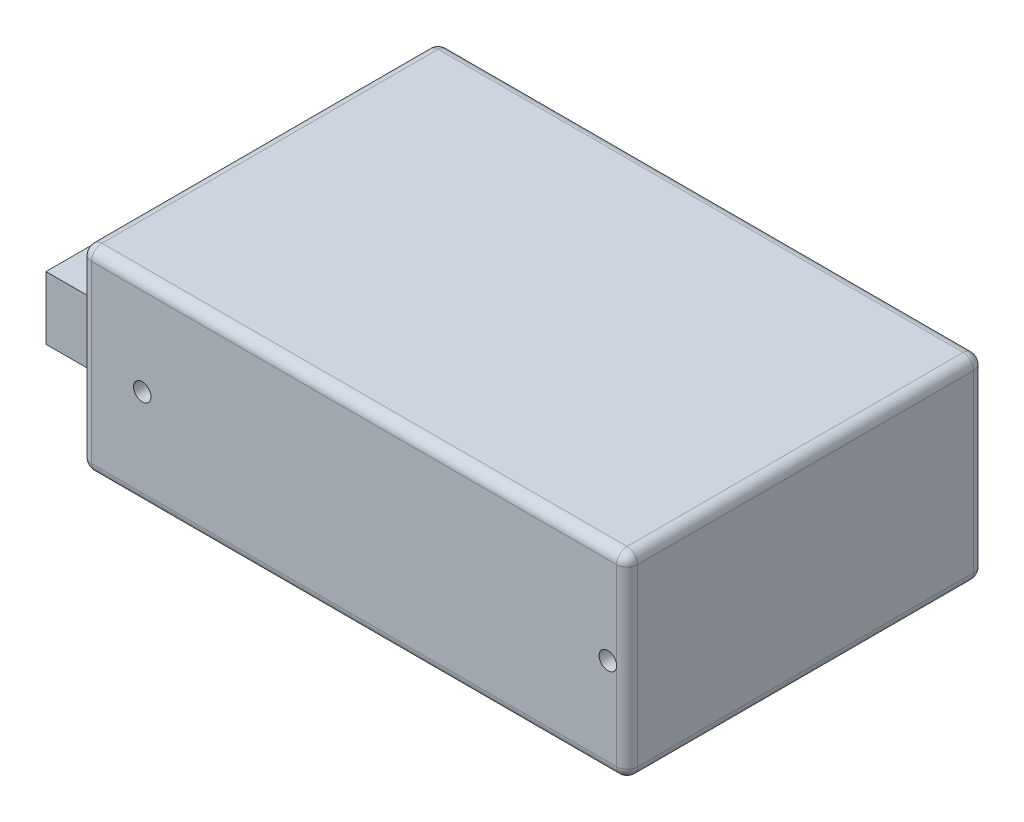
ISO-10303-21;
HEADER;
FILE_DESCRIPTION(('STEP AP214'),'2;1');
FILE_NAME('part.step','',(''),(''),'','','');
FILE_SCHEMA(('AUTOMOTIVE_DESIGN { 1 0 10303 214 1 1 1 1 }'));
ENDSEC;
DATA;
#1=APPLICATION_CONTEXT('core data for automotive mechanical design processes');
#2=APPLICATION_PROTOCOL_DEFINITION('international standard','automotive_design',2000,#1);
#3=PRODUCT_CONTEXT('',#1,'mechanical');
#4=PRODUCT('Part','Part','',(#3));
#5=PRODUCT_RELATED_PRODUCT_CATEGORY('part','',(#4));
#6=PRODUCT_DEFINITION_FORMATION('','',#4);
#7=PRODUCT_DEFINITION_CONTEXT('part definition',#1,'design');
#8=PRODUCT_DEFINITION('design','',#6,#7);
#9=PRODUCT_DEFINITION_SHAPE('','',#8);
#10=(LENGTH_UNIT() NAMED_UNIT(*) SI_UNIT(.MILLI.,.METRE.));
#11=(NAMED_UNIT(*) PLANE_ANGLE_UNIT() SI_UNIT($,.RADIAN.));
#12=(NAMED_UNIT(*) SI_UNIT($,.STERADIAN.) SOLID_ANGLE_UNIT());
#13=UNCERTAINTY_MEASURE_WITH_UNIT(LENGTH_MEASURE(1.E-05),#10,'distance_accuracy_value','');
#14=(GEOMETRIC_REPRESENTATION_CONTEXT(3) GLOBAL_UNCERTAINTY_ASSIGNED_CONTEXT((#13)) GLOBAL_UNIT_ASSIGNED_CONTEXT((#10,
#11,#12)) REPRESENTATION_CONTEXT('',''));
#15=CARTESIAN_POINT('',(0.,0.,0.));
#16=DIRECTION('',(0.,0.,1.));
#17=DIRECTION('',(1.,0.,0.));
#18=AXIS2_PLACEMENT_3D('',#15,#16,#17);
#19=CARTESIAN_POINT('',(-53.,4.,16.5));
#20=DIRECTION('',(0.,0.,-1.));
#21=DIRECTION('',(-1.,0.,0.));
#22=AXIS2_PLACEMENT_3D('',#19,#20,#21);
#23=PLANE('',#22);
#24=DIRECTION('',(0.,1.,0.));
#25=VECTOR('',#24,1.);
#26=CARTESIAN_POINT('',(-39.,4.,16.5));
#27=LINE('',#26,#25);
#28=CARTESIAN_POINT('',(-39.,4.,16.5));
#29=VERTEX_POINT('',#28);
#30=CARTESIAN_POINT('',(-39.,13.,16.5));
#31=VERTEX_POINT('',#30);
#32=EDGE_CURVE('E112',#29,#31,#27,.T.);
#33=ORIENTED_EDGE('',*,*,#32,.T.);
#34=DIRECTION('',(1.,0.,0.));
#35=VECTOR('',#34,1.);
#36=CARTESIAN_POINT('',(-53.,13.,16.5));
#37=LINE('',#36,#35);
#38=CARTESIAN_POINT('',(-53.,13.,16.5));
#39=VERTEX_POINT('',#38);
#40=EDGE_CURVE('E12',#39,#31,#37,.T.);
#41=ORIENTED_EDGE('',*,*,#40,.F.);
#42=DIRECTION('',(0.,1.,0.));
#43=VECTOR('',#42,1.);
#44=CARTESIAN_POINT('',(-53.,4.,16.5));
#45=LINE('',#44,#43);
#46=CARTESIAN_POINT('',(-53.,4.,16.5));
#47=VERTEX_POINT('',#46);
#48=EDGE_CURVE('E100',#47,#39,#45,.T.);
#49=ORIENTED_EDGE('',*,*,#48,.F.);
#50=DIRECTION('',(1.,0.,0.));
#51=VECTOR('',#50,1.);
#52=CARTESIAN_POINT('',(-53.,4.,16.5));
#53=LINE('',#52,#51);
#54=EDGE_CURVE('E108',#47,#29,#53,.T.);
#55=ORIENTED_EDGE('',*,*,#54,.T.);
#56=EDGE_LOOP('',(#33,#41,#49,#55));
#57=FACE_BOUND('',#56,.T.);
#58=ADVANCED_FACE('F49',(#57),#23,.F.);
#59=CARTESIAN_POINT('',(-53.,13.,-23.5));
#60=DIRECTION('',(0.,-1.,0.));
#61=DIRECTION('',(0.,0.,-1.));
#62=AXIS2_PLACEMENT_3D('',#59,#60,#61);
#63=PLANE('',#62);
#64=DIRECTION('',(0.,0.,-1.));
#65=VECTOR('',#64,1.);
#66=CARTESIAN_POINT('',(-39.,13.,-23.5));
#67=LINE('',#66,#65);
#68=CARTESIAN_POINT('',(-39.,13.,-23.5));
#69=VERTEX_POINT('',#68);
#70=EDGE_CURVE('E104',#31,#69,#67,.T.);
#71=ORIENTED_EDGE('',*,*,#70,.T.);
#72=DIRECTION('',(1.,0.,0.));
#73=VECTOR('',#72,1.);
#74=CARTESIAN_POINT('',(-53.,13.,-23.5));
#75=LINE('',#74,#73);
#76=CARTESIAN_POINT('',(-53.,13.,-23.5));
#77=VERTEX_POINT('',#76);
#78=EDGE_CURVE('E57',#77,#69,#75,.T.);
#79=ORIENTED_EDGE('',*,*,#78,.F.);
#80=DIRECTION('',(0.,0.,-1.));
#81=VECTOR('',#80,1.);
#82=CARTESIAN_POINT('',(-53.,13.,-23.5));
#83=LINE('',#82,#81);
#84=EDGE_CURVE('E95',#39,#77,#83,.T.);
#85=ORIENTED_EDGE('',*,*,#84,.F.);
#86=ORIENTED_EDGE('',*,*,#40,.T.);
#87=EDGE_LOOP('',(#71,#79,#85,#86));
#88=FACE_BOUND('',#87,.T.);
#89=ADVANCED_FACE('F103',(#88),#63,.F.);
#90=CARTESIAN_POINT('',(-53.,4.,-23.5));
#91=DIRECTION('',(0.,0.,1.));
#92=DIRECTION('',(1.,0.,0.));
#93=AXIS2_PLACEMENT_3D('',#90,#91,#92);
#94=PLANE('',#93);
#95=DIRECTION('',(0.,-1.,0.));
#96=VECTOR('',#95,1.);
#97=CARTESIAN_POINT('',(-39.,4.,-23.5));
#98=LINE('',#97,#96);
#99=CARTESIAN_POINT('',(-39.,4.,-23.5));
#100=VERTEX_POINT('',#99);
#101=EDGE_CURVE('E82',#69,#100,#98,.T.);
#102=ORIENTED_EDGE('',*,*,#101,.T.);
#103=DIRECTION('',(1.,0.,0.));
#104=VECTOR('',#103,1.);
#105=CARTESIAN_POINT('',(-53.,4.,-23.5));
#106=LINE('',#105,#104);
#107=CARTESIAN_POINT('',(-53.,4.,-23.5));
#108=VERTEX_POINT('',#107);
#109=EDGE_CURVE('E105',#108,#100,#106,.T.);
#110=ORIENTED_EDGE('',*,*,#109,.F.);
#111=DIRECTION('',(0.,-1.,0.));
#112=VECTOR('',#111,1.);
#113=CARTESIAN_POINT('',(-53.,4.,-23.5));
#114=LINE('',#113,#112);
#115=EDGE_CURVE('E98',#77,#108,#114,.T.);
#116=ORIENTED_EDGE('',*,*,#115,.F.);
#117=ORIENTED_EDGE('',*,*,#78,.T.);
#118=EDGE_LOOP('',(#102,#110,#116,#117));
#119=FACE_BOUND('',#118,.T.);
#120=ADVANCED_FACE('F106',(#119),#94,.F.);
#121=CARTESIAN_POINT('',(-53.,4.,-23.5));
#122=DIRECTION('',(0.,1.,0.));
#123=DIRECTION('',(0.,0.,1.));
#124=AXIS2_PLACEMENT_3D('',#121,#122,#123);
#125=PLANE('',#124);
#126=DIRECTION('',(0.,0.,1.));
#127=VECTOR('',#126,1.);
#128=CARTESIAN_POINT('',(-39.,4.,-23.5));
#129=LINE('',#128,#127);
#130=EDGE_CURVE('E88',#100,#29,#129,.T.);
#131=ORIENTED_EDGE('',*,*,#130,.T.);
#132=ORIENTED_EDGE('',*,*,#54,.F.);
#133=DIRECTION('',(0.,0.,1.));
#134=VECTOR('',#133,1.);
#135=CARTESIAN_POINT('',(-53.,4.,-23.5));
#136=LINE('',#135,#134);
#137=EDGE_CURVE('E65',#108,#47,#136,.T.);
#138=ORIENTED_EDGE('',*,*,#137,.F.);
#139=ORIENTED_EDGE('',*,*,#109,.T.);
#140=EDGE_LOOP('',(#131,#132,#138,#139));
#141=FACE_BOUND('',#140,.T.);
#142=ADVANCED_FACE('F119',(#141),#125,.F.);
#143=CARTESIAN_POINT('',(-53.,0.,0.));
#144=DIRECTION('',(1.,0.,0.));
#145=DIRECTION('',(0.,0.,-1.));
#146=AXIS2_PLACEMENT_3D('',#143,#144,#145);
#147=PLANE('',#146);
#148=ORIENTED_EDGE('',*,*,#48,.T.);
#149=ORIENTED_EDGE('',*,*,#84,.T.);
#150=ORIENTED_EDGE('',*,*,#115,.T.);
#151=ORIENTED_EDGE('',*,*,#137,.T.);
#152=EDGE_LOOP('',(#148,#149,#150,#151));
#153=FACE_BOUND('',#152,.T.);
#154=ADVANCED_FACE('F96',(#153),#147,.F.);
#155=CARTESIAN_POINT('',(-39.,0.,0.));
#156=DIRECTION('',(1.,0.,0.));
#157=DIRECTION('',(0.,0.,-1.));
#158=AXIS2_PLACEMENT_3D('',#155,#156,#157);
#159=PLANE('',#158);
#160=ORIENTED_EDGE('',*,*,#32,.F.);
#161=ORIENTED_EDGE('',*,*,#130,.F.);
#162=ORIENTED_EDGE('',*,*,#101,.F.);
#163=ORIENTED_EDGE('',*,*,#70,.F.);
#164=EDGE_LOOP('',(#160,#161,#162,#163));
#165=FACE_BOUND('',#164,.T.);
#166=ADVANCED_FACE('F122',(#165),#159,.T.);
#167=CLOSED_SHELL('',(#58,#89,#120,#142,#154,#166));
#168=MANIFOLD_SOLID_BREP('B2',#167);
#169=CARTESIAN_POINT('',(39.,28.,25.5));
#170=DIRECTION('',(-1.,0.,0.));
#171=DIRECTION('',(0.,0.,1.));
#172=AXIS2_PLACEMENT_3D('',#169,#170,#171);
#173=PLANE('',#172);
#174=DIRECTION('',(0.,-1.,0.));
#175=VECTOR('',#174,1.);
#176=CARTESIAN_POINT('',(39.,28.,24.));
#177=LINE('',#176,#175);
#178=CARTESIAN_POINT('',(39.,26.5,24.));
#179=VERTEX_POINT('',#178);
#180=CARTESIAN_POINT('',(39.,1.5,24.));
#181=VERTEX_POINT('',#180);
#182=EDGE_CURVE('E349',#179,#181,#177,.T.);
#183=ORIENTED_EDGE('',*,*,#182,.T.);
#184=DIRECTION('',(0.,0.,-1.));
#185=VECTOR('',#184,1.);
#186=CARTESIAN_POINT('',(39.,1.5,-25.5));
#187=LINE('',#186,#185);
#188=CARTESIAN_POINT('',(39.,1.5,-24.));
#189=VERTEX_POINT('',#188);
#190=EDGE_CURVE('E352',#181,#189,#187,.T.);
#191=ORIENTED_EDGE('',*,*,#190,.T.);
#192=DIRECTION('',(0.,-1.,0.));
#193=VECTOR('',#192,1.);
#194=CARTESIAN_POINT('',(39.,28.,-24.));
#195=LINE('',#194,#193);
#196=CARTESIAN_POINT('',(39.,26.5,-24.));
#197=VERTEX_POINT('',#196);
#198=EDGE_CURVE('E347',#189,#197,#195,.F.);
#199=ORIENTED_EDGE('',*,*,#198,.T.);
#200=DIRECTION('',(0.,0.,-1.));
#201=VECTOR('',#200,1.);
#202=CARTESIAN_POINT('',(39.,26.5,25.5));
#203=LINE('',#202,#201);
#204=EDGE_CURVE('E345',#197,#179,#203,.F.);
#205=ORIENTED_EDGE('',*,*,#204,.T.);
#206=EDGE_LOOP('',(#183,#191,#199,#205));
#207=FACE_BOUND('',#206,.T.);
#208=ADVANCED_FACE('F173',(#207),#173,.F.);
#209=CARTESIAN_POINT('',(-39.,28.,-25.5));
#210=DIRECTION('',(0.,0.,1.));
#211=DIRECTION('',(1.,0.,0.));
#212=AXIS2_PLACEMENT_3D('',#209,#210,#211);
#213=PLANE('',#212);
#214=DIRECTION('',(0.,-1.,0.));
#215=VECTOR('',#214,1.);
#216=CARTESIAN_POINT('',(-37.5,28.,-25.5));
#217=LINE('',#216,#215);
#218=CARTESIAN_POINT('',(-37.5,1.5,-25.5));
#219=VERTEX_POINT('',#218);
#220=CARTESIAN_POINT('',(-37.5,26.5,-25.5));
#221=VERTEX_POINT('',#220);
#222=EDGE_CURVE('E320',#219,#221,#217,.F.);
#223=ORIENTED_EDGE('',*,*,#222,.T.);
#224=DIRECTION('',(-1.,0.,0.));
#225=VECTOR('',#224,1.);
#226=CARTESIAN_POINT('',(-39.,26.5,-25.5));
#227=LINE('',#226,#225);
#228=CARTESIAN_POINT('',(37.5,26.5,-25.5));
#229=VERTEX_POINT('',#228);
#230=EDGE_CURVE('E323',#221,#229,#227,.F.);
#231=ORIENTED_EDGE('',*,*,#230,.T.);
#232=DIRECTION('',(0.,-1.,0.));
#233=VECTOR('',#232,1.);
#234=CARTESIAN_POINT('',(37.5,28.,-25.5));
#235=LINE('',#234,#233);
#236=CARTESIAN_POINT('',(37.5,1.5,-25.5));
#237=VERTEX_POINT('',#236);
#238=EDGE_CURVE('E318',#229,#237,#235,.T.);
#239=ORIENTED_EDGE('',*,*,#238,.T.);
#240=DIRECTION('',(-1.,0.,0.));
#241=VECTOR('',#240,1.);
#242=CARTESIAN_POINT('',(-39.,1.5,-25.5));
#243=LINE('',#242,#241);
#244=EDGE_CURVE('E316',#237,#219,#243,.T.);
#245=ORIENTED_EDGE('',*,*,#244,.T.);
#246=EDGE_LOOP('',(#223,#231,#239,#245));
#247=FACE_BOUND('',#246,.T.);
#248=ADVANCED_FACE('F491',(#247),#213,.F.);
#249=CARTESIAN_POINT('',(-39.,28.,25.5));
#250=DIRECTION('',(1.,0.,0.));
#251=DIRECTION('',(0.,0.,-1.));
#252=AXIS2_PLACEMENT_3D('',#249,#250,#251);
#253=PLANE('',#252);
#254=DIRECTION('',(0.,-1.,0.));
#255=VECTOR('',#254,1.);
#256=CARTESIAN_POINT('',(-39.,28.,-24.));
#257=LINE('',#256,#255);
#258=CARTESIAN_POINT('',(-39.,26.5,-24.));
#259=VERTEX_POINT('',#258);
#260=CARTESIAN_POINT('',(-39.,1.5,-24.));
#261=VERTEX_POINT('',#260);
#262=EDGE_CURVE('E311',#259,#261,#257,.T.);
#263=ORIENTED_EDGE('',*,*,#262,.T.);
#264=DIRECTION('',(0.,0.,1.));
#265=VECTOR('',#264,1.);
#266=CARTESIAN_POINT('',(-39.,1.5,25.5));
#267=LINE('',#266,#265);
#268=CARTESIAN_POINT('',(-39.,1.5,24.));
#269=VERTEX_POINT('',#268);
#270=EDGE_CURVE('E314',#261,#269,#267,.T.);
#271=ORIENTED_EDGE('',*,*,#270,.T.);
#272=DIRECTION('',(0.,-1.,0.));
#273=VECTOR('',#272,1.);
#274=CARTESIAN_POINT('',(-39.,28.,24.));
#275=LINE('',#274,#273);
#276=CARTESIAN_POINT('',(-39.,26.5,24.));
#277=VERTEX_POINT('',#276);
#278=EDGE_CURVE('E309',#269,#277,#275,.F.);
#279=ORIENTED_EDGE('',*,*,#278,.T.);
#280=DIRECTION('',(0.,0.,1.));
#281=VECTOR('',#280,1.);
#282=CARTESIAN_POINT('',(-39.,26.5,25.5));
#283=LINE('',#282,#281);
#284=EDGE_CURVE('E307',#277,#259,#283,.F.);
#285=ORIENTED_EDGE('',*,*,#284,.T.);
#286=EDGE_LOOP('',(#263,#271,#279,#285));
#287=FACE_BOUND('',#286,.T.);
#288=ADVANCED_FACE('F456',(#287),#253,.F.);
#289=CARTESIAN_POINT('',(-39.,28.,25.5));
#290=DIRECTION('',(0.,0.,-1.));
#291=DIRECTION('',(-1.,0.,0.));
#292=AXIS2_PLACEMENT_3D('',#289,#290,#291);
#293=PLANE('',#292);
#294=CARTESIAN_POINT('',(36.25,14.,25.5));
#295=DIRECTION('',(0.,0.,1.));
#296=DIRECTION('',(1.,0.,0.));
#297=AXIS2_PLACEMENT_3D('',#294,#295,#296);
#298=CIRCLE('',#297,1.24999999999999);
#299=CARTESIAN_POINT('',(37.5,14.,25.5));
#300=VERTEX_POINT('',#299);
#301=EDGE_CURVE('E301',#300,#300,#298,.T.);
#302=ORIENTED_EDGE('',*,*,#301,.F.);
#303=DIRECTION('',(0.,-1.,0.));
#304=VECTOR('',#303,1.);
#305=CARTESIAN_POINT('',(37.5,28.,25.5));
#306=LINE('',#305,#304);
#307=CARTESIAN_POINT('',(37.5,26.5,25.5));
#308=VERTEX_POINT('',#307);
#309=EDGE_CURVE('E334',#300,#308,#306,.F.);
#310=ORIENTED_EDGE('',*,*,#309,.T.);
#311=DIRECTION('',(1.,0.,0.));
#312=VECTOR('',#311,1.);
#313=CARTESIAN_POINT('',(-39.,26.5,25.5));
#314=LINE('',#313,#312);
#315=CARTESIAN_POINT('',(-37.5,26.5,25.5));
#316=VERTEX_POINT('',#315);
#317=EDGE_CURVE('E332',#308,#316,#314,.F.);
#318=ORIENTED_EDGE('',*,*,#317,.T.);
#319=DIRECTION('',(0.,-1.,0.));
#320=VECTOR('',#319,1.);
#321=CARTESIAN_POINT('',(-37.5,28.,25.5));
#322=LINE('',#321,#320);
#323=CARTESIAN_POINT('',(-37.5,1.5,25.5));
#324=VERTEX_POINT('',#323);
#325=EDGE_CURVE('E329',#316,#324,#322,.T.);
#326=ORIENTED_EDGE('',*,*,#325,.T.);
#327=DIRECTION('',(1.,0.,0.));
#328=VECTOR('',#327,1.);
#329=CARTESIAN_POINT('',(39.,1.5,25.5));
#330=LINE('',#329,#328);
#331=CARTESIAN_POINT('',(37.5,1.5,25.5));
#332=VERTEX_POINT('',#331);
#333=EDGE_CURVE('E325',#324,#332,#330,.T.);
#334=ORIENTED_EDGE('',*,*,#333,.T.);
#335=DIRECTION('',(0.,-1.,0.));
#336=VECTOR('',#335,1.);
#337=CARTESIAN_POINT('',(37.5,28.,25.5));
#338=LINE('',#337,#336);
#339=EDGE_CURVE('E327',#332,#300,#338,.F.);
#340=ORIENTED_EDGE('',*,*,#339,.T.);
#341=EDGE_LOOP('',(#302,#310,#318,#326,#334,#340));
#342=FACE_BOUND('',#341,.T.);
#343=CARTESIAN_POINT('',(-30.25,14.,25.5));
#344=DIRECTION('',(0.,0.,1.));
#345=DIRECTION('',(1.,0.,0.));
#346=AXIS2_PLACEMENT_3D('',#343,#344,#345);
#347=CIRCLE('',#346,1.24999999999999);
#348=CARTESIAN_POINT('',(-29.,14.,25.5));
#349=VERTEX_POINT('',#348);
#350=EDGE_CURVE('E295',#349,#349,#347,.T.);
#351=ORIENTED_EDGE('',*,*,#350,.F.);
#352=EDGE_LOOP('',(#351));
#353=FACE_BOUND('',#352,.T.);
#354=ADVANCED_FACE('F467',(#342,#353),#293,.F.);
#355=CARTESIAN_POINT('',(0.,28.,0.));
#356=DIRECTION('',(0.,-1.,0.));
#357=DIRECTION('',(0.,0.,-1.));
#358=AXIS2_PLACEMENT_3D('',#355,#356,#357);
#359=PLANE('',#358);
#360=DIRECTION('',(0.,0.,1.));
#361=VECTOR('',#360,1.);
#362=CARTESIAN_POINT('',(-37.5,28.,0.));
#363=LINE('',#362,#361);
#364=CARTESIAN_POINT('',(-37.5,28.,-24.));
#365=VERTEX_POINT('',#364);
#366=CARTESIAN_POINT('',(-37.5,28.,24.));
#367=VERTEX_POINT('',#366);
#368=EDGE_CURVE('E182',#365,#367,#363,.T.);
#369=ORIENTED_EDGE('',*,*,#368,.T.);
#370=DIRECTION('',(1.,0.,0.));
#371=VECTOR('',#370,1.);
#372=CARTESIAN_POINT('',(0.,28.,24.));
#373=LINE('',#372,#371);
#374=CARTESIAN_POINT('',(37.5,28.,24.));
#375=VERTEX_POINT('',#374);
#376=EDGE_CURVE('E47',#367,#375,#373,.T.);
#377=ORIENTED_EDGE('',*,*,#376,.T.);
#378=DIRECTION('',(0.,0.,-1.));
#379=VECTOR('',#378,1.);
#380=CARTESIAN_POINT('',(37.5,28.,0.));
#381=LINE('',#380,#379);
#382=CARTESIAN_POINT('',(37.5,28.,-24.));
#383=VERTEX_POINT('',#382);
#384=EDGE_CURVE('E354',#375,#383,#381,.T.);
#385=ORIENTED_EDGE('',*,*,#384,.T.);
#386=DIRECTION('',(-1.,0.,0.));
#387=VECTOR('',#386,1.);
#388=CARTESIAN_POINT('',(0.,28.,-24.));
#389=LINE('',#388,#387);
#390=EDGE_CURVE('E193',#383,#365,#389,.T.);
#391=ORIENTED_EDGE('',*,*,#390,.T.);
#392=EDGE_LOOP('',(#369,#377,#385,#391));
#393=FACE_BOUND('',#392,.T.);
#394=ADVANCED_FACE('F441',(#393),#359,.F.);
#395=CARTESIAN_POINT('',(0.,0.,0.));
#396=DIRECTION('',(0.,-1.,0.));
#397=DIRECTION('',(0.,0.,-1.));
#398=AXIS2_PLACEMENT_3D('',#395,#396,#397);
#399=PLANE('',#398);
#400=DIRECTION('',(0.,0.,1.));
#401=VECTOR('',#400,1.);
#402=CARTESIAN_POINT('',(-37.5,0.,-25.5));
#403=LINE('',#402,#401);
#404=CARTESIAN_POINT('',(-37.5,0.,24.));
#405=VERTEX_POINT('',#404);
#406=CARTESIAN_POINT('',(-37.5,0.,-24.));
#407=VERTEX_POINT('',#406);
#408=EDGE_CURVE('E340',#405,#407,#403,.F.);
#409=ORIENTED_EDGE('',*,*,#408,.T.);
#410=DIRECTION('',(-1.,0.,0.));
#411=VECTOR('',#410,1.);
#412=CARTESIAN_POINT('',(39.,0.,-24.));
#413=LINE('',#412,#411);
#414=CARTESIAN_POINT('',(37.5,0.,-24.));
#415=VERTEX_POINT('',#414);
#416=EDGE_CURVE('E343',#407,#415,#413,.F.);
#417=ORIENTED_EDGE('',*,*,#416,.T.);
#418=DIRECTION('',(0.,0.,-1.));
#419=VECTOR('',#418,1.);
#420=CARTESIAN_POINT('',(37.5,0.,25.5));
#421=LINE('',#420,#419);
#422=CARTESIAN_POINT('',(37.5,0.,24.));
#423=VERTEX_POINT('',#422);
#424=EDGE_CURVE('E338',#415,#423,#421,.F.);
#425=ORIENTED_EDGE('',*,*,#424,.T.);
#426=DIRECTION('',(1.,0.,0.));
#427=VECTOR('',#426,1.);
#428=CARTESIAN_POINT('',(-39.,0.,24.));
#429=LINE('',#428,#427);
#430=EDGE_CURVE('E336',#423,#405,#429,.F.);
#431=ORIENTED_EDGE('',*,*,#430,.T.);
#432=EDGE_LOOP('',(#409,#417,#425,#431));
#433=FACE_BOUND('',#432,.T.);
#434=CARTESIAN_POINT('',(-26.5,0.,0.0999999999999994));
#435=DIRECTION('',(0.,-1.,0.));
#436=DIRECTION('',(0.,0.,-1.));
#437=AXIS2_PLACEMENT_3D('',#434,#435,#436);
#438=CIRCLE('',#437,1.24999999999999);
#439=CARTESIAN_POINT('',(-26.5,0.,-1.14999999999999));
#440=VERTEX_POINT('',#439);
#441=EDGE_CURVE('E285',#440,#440,#438,.T.);
#442=ORIENTED_EDGE('',*,*,#441,.F.);
#443=EDGE_LOOP('',(#442));
#444=FACE_BOUND('',#443,.T.);
#445=CARTESIAN_POINT('',(28.5,0.,0.0999999999999994));
#446=DIRECTION('',(0.,-1.,0.));
#447=DIRECTION('',(0.,0.,-1.));
#448=AXIS2_PLACEMENT_3D('',#445,#446,#447);
#449=CIRCLE('',#448,1.24999999999999);
#450=CARTESIAN_POINT('',(28.5,0.,-1.14999999999999));
#451=VERTEX_POINT('',#450);
#452=EDGE_CURVE('E284',#451,#451,#449,.T.);
#453=ORIENTED_EDGE('',*,*,#452,.F.);
#454=EDGE_LOOP('',(#453));
#455=FACE_BOUND('',#454,.T.);
#456=ADVANCED_FACE('F486',(#433,#444,#455),#399,.T.);
#457=CARTESIAN_POINT('',(36.25,14.,18.5));
#458=DIRECTION('',(0.,0.,1.));
#459=DIRECTION('',(1.,0.,0.));
#460=AXIS2_PLACEMENT_3D('',#457,#458,#459);
#461=CONICAL_SURFACE('',#460,1.24999999999999,1.02974425867665);
#462=CARTESIAN_POINT('',(36.25,14.,17.7489242262155));
#463=VERTEX_POINT('',#462);
#464=VERTEX_LOOP('',#463);
#465=FACE_BOUND('',#464,.T.);
#466=CARTESIAN_POINT('',(36.25,14.,18.5));
#467=DIRECTION('',(0.,0.,1.));
#468=DIRECTION('',(1.,0.,0.));
#469=AXIS2_PLACEMENT_3D('',#466,#467,#468);
#470=CIRCLE('',#469,1.24999999999999);
#471=CARTESIAN_POINT('',(37.5,14.,18.5));
#472=VERTEX_POINT('',#471);
#473=EDGE_CURVE('E304',#472,#472,#470,.T.);
#474=ORIENTED_EDGE('',*,*,#473,.T.);
#475=EDGE_LOOP('',(#474));
#476=FACE_BOUND('',#475,.T.);
#477=ADVANCED_FACE('F474',(#465,#476),#461,.F.);
#478=CARTESIAN_POINT('',(36.25,14.,25.5));
#479=DIRECTION('',(0.,0.,1.));
#480=DIRECTION('',(1.,0.,0.));
#481=AXIS2_PLACEMENT_3D('',#478,#479,#480);
#482=CYLINDRICAL_SURFACE('',#481,1.24999999999999);
#483=ORIENTED_EDGE('',*,*,#473,.F.);
#484=EDGE_LOOP('',(#483));
#485=FACE_BOUND('',#484,.T.);
#486=ORIENTED_EDGE('',*,*,#301,.T.);
#487=EDGE_LOOP('',(#486));
#488=FACE_BOUND('',#487,.T.);
#489=ADVANCED_FACE('F471',(#485,#488),#482,.F.);
#490=CARTESIAN_POINT('',(-30.25,14.,18.5));
#491=DIRECTION('',(0.,0.,1.));
#492=DIRECTION('',(1.,0.,0.));
#493=AXIS2_PLACEMENT_3D('',#490,#491,#492);
#494=CONICAL_SURFACE('',#493,1.24999999999999,1.02974425867665);
#495=CARTESIAN_POINT('',(-30.25,14.,17.7489242262155));
#496=VERTEX_POINT('',#495);
#497=VERTEX_LOOP('',#496);
#498=FACE_BOUND('',#497,.T.);
#499=CARTESIAN_POINT('',(-30.25,14.,18.5));
#500=DIRECTION('',(0.,0.,1.));
#501=DIRECTION('',(1.,0.,0.));
#502=AXIS2_PLACEMENT_3D('',#499,#500,#501);
#503=CIRCLE('',#502,1.24999999999999);
#504=CARTESIAN_POINT('',(-29.,14.,18.5));
#505=VERTEX_POINT('',#504);
#506=EDGE_CURVE('E298',#505,#505,#503,.T.);
#507=ORIENTED_EDGE('',*,*,#506,.T.);
#508=EDGE_LOOP('',(#507));
#509=FACE_BOUND('',#508,.T.);
#510=ADVANCED_FACE('F473',(#498,#509),#494,.F.);
#511=CARTESIAN_POINT('',(-30.25,14.,25.5));
#512=DIRECTION('',(0.,0.,1.));
#513=DIRECTION('',(1.,0.,0.));
#514=AXIS2_PLACEMENT_3D('',#511,#512,#513);
#515=CYLINDRICAL_SURFACE('',#514,1.24999999999999);
#516=ORIENTED_EDGE('',*,*,#506,.F.);
#517=EDGE_LOOP('',(#516));
#518=FACE_BOUND('',#517,.T.);
#519=ORIENTED_EDGE('',*,*,#350,.T.);
#520=EDGE_LOOP('',(#519));
#521=FACE_BOUND('',#520,.T.);
#522=ADVANCED_FACE('F482',(#518,#521),#515,.F.);
#523=CARTESIAN_POINT('',(28.5,7.00000000000001,0.0999999999999994));
#524=DIRECTION('',(0.,-1.,0.));
#525=DIRECTION('',(0.,0.,-1.));
#526=AXIS2_PLACEMENT_3D('',#523,#524,#525);
#527=CONICAL_SURFACE('',#526,1.24999999999999,1.02974425867665);
#528=CARTESIAN_POINT('',(28.5,7.75107577378445,0.0999999999999994));
#529=VERTEX_POINT('',#528);
#530=VERTEX_LOOP('',#529);
#531=FACE_BOUND('',#530,.T.);
#532=CARTESIAN_POINT('',(28.5,7.00000000000001,0.0999999999999994));
#533=DIRECTION('',(0.,-1.,0.));
#534=DIRECTION('',(0.,0.,-1.));
#535=AXIS2_PLACEMENT_3D('',#532,#533,#534);
#536=CIRCLE('',#535,1.24999999999999);
#537=CARTESIAN_POINT('',(28.5,7.00000000000001,-1.14999999999999));
#538=VERTEX_POINT('',#537);
#539=EDGE_CURVE('E288',#538,#538,#536,.T.);
#540=ORIENTED_EDGE('',*,*,#539,.T.);
#541=EDGE_LOOP('',(#540));
#542=FACE_BOUND('',#541,.T.);
#543=ADVANCED_FACE('F574',(#531,#542),#527,.F.);
#544=CARTESIAN_POINT('',(28.5,0.,0.0999999999999994));
#545=DIRECTION('',(0.,-1.,0.));
#546=DIRECTION('',(0.,0.,-1.));
#547=AXIS2_PLACEMENT_3D('',#544,#545,#546);
#548=CYLINDRICAL_SURFACE('',#547,1.24999999999999);
#549=ORIENTED_EDGE('',*,*,#539,.F.);
#550=EDGE_LOOP('',(#549));
#551=FACE_BOUND('',#550,.T.);
#552=ORIENTED_EDGE('',*,*,#452,.T.);
#553=EDGE_LOOP('',(#552));
#554=FACE_BOUND('',#553,.T.);
#555=ADVANCED_FACE('F278',(#551,#554),#548,.F.);
#556=CARTESIAN_POINT('',(-26.5,7.00000000000001,0.0999999999999994));
#557=DIRECTION('',(0.,-1.,0.));
#558=DIRECTION('',(0.,0.,-1.));
#559=AXIS2_PLACEMENT_3D('',#556,#557,#558);
#560=CONICAL_SURFACE('',#559,1.24999999999999,1.02974425867665);
#561=CARTESIAN_POINT('',(-26.5,7.75107577378445,0.0999999999999994));
#562=VERTEX_POINT('',#561);
#563=VERTEX_LOOP('',#562);
#564=FACE_BOUND('',#563,.T.);
#565=CARTESIAN_POINT('',(-26.5,7.00000000000001,0.0999999999999994));
#566=DIRECTION('',(0.,-1.,0.));
#567=DIRECTION('',(0.,0.,-1.));
#568=AXIS2_PLACEMENT_3D('',#565,#566,#567);
#569=CIRCLE('',#568,1.24999999999999);
#570=CARTESIAN_POINT('',(-26.5,7.00000000000001,-1.14999999999999));
#571=VERTEX_POINT('',#570);
#572=EDGE_CURVE('E282',#571,#571,#569,.T.);
#573=ORIENTED_EDGE('',*,*,#572,.T.);
#574=EDGE_LOOP('',(#573));
#575=FACE_BOUND('',#574,.T.);
#576=ADVANCED_FACE('F274',(#564,#575),#560,.F.);
#577=CARTESIAN_POINT('',(-26.5,0.,0.0999999999999994));
#578=DIRECTION('',(0.,-1.,0.));
#579=DIRECTION('',(0.,0.,-1.));
#580=AXIS2_PLACEMENT_3D('',#577,#578,#579);
#581=CYLINDRICAL_SURFACE('',#580,1.24999999999999);
#582=ORIENTED_EDGE('',*,*,#572,.F.);
#583=EDGE_LOOP('',(#582));
#584=FACE_BOUND('',#583,.T.);
#585=ORIENTED_EDGE('',*,*,#441,.T.);
#586=EDGE_LOOP('',(#585));
#587=FACE_BOUND('',#586,.T.);
#588=ADVANCED_FACE('F277',(#584,#587),#581,.F.);
#589=CARTESIAN_POINT('',(37.5,28.,24.));
#590=DIRECTION('',(0.,-1.,0.));
#591=DIRECTION('',(0.,0.,-1.));
#592=AXIS2_PLACEMENT_3D('',#589,#590,#591);
#593=CYLINDRICAL_SURFACE('',#592,1.5);
#594=CARTESIAN_POINT('',(37.5,26.5,24.));
#595=DIRECTION('',(0.,1.,0.));
#596=DIRECTION('',(0.,0.,1.));
#597=AXIS2_PLACEMENT_3D('',#594,#595,#596);
#598=CIRCLE('',#597,1.5);
#599=EDGE_CURVE('E177',#308,#179,#598,.T.);
#600=ORIENTED_EDGE('',*,*,#599,.F.);
#601=ORIENTED_EDGE('',*,*,#309,.F.);
#602=ORIENTED_EDGE('',*,*,#339,.F.);
#603=CARTESIAN_POINT('',(37.5,1.5,24.));
#604=DIRECTION('',(0.,-1.,0.));
#605=DIRECTION('',(0.,0.,-1.));
#606=AXIS2_PLACEMENT_3D('',#603,#604,#605);
#607=CIRCLE('',#606,1.5);
#608=EDGE_CURVE('E419',#181,#332,#607,.T.);
#609=ORIENTED_EDGE('',*,*,#608,.F.);
#610=ORIENTED_EDGE('',*,*,#182,.F.);
#611=EDGE_LOOP('',(#600,#601,#602,#609,#610));
#612=FACE_BOUND('',#611,.T.);
#613=ADVANCED_FACE('F175',(#612),#593,.T.);
#614=CARTESIAN_POINT('',(37.5,26.5,24.));
#615=DIRECTION('',(1.,0.,0.));
#616=DIRECTION('',(0.,0.,-1.));
#617=AXIS2_PLACEMENT_3D('',#614,#615,#616);
#618=SPHERICAL_SURFACE('',#617,1.5);
#619=CARTESIAN_POINT('',(37.5,26.5,24.));
#620=DIRECTION('',(1.,0.,0.));
#621=DIRECTION('',(0.,0.,-1.));
#622=AXIS2_PLACEMENT_3D('',#619,#620,#621);
#623=CIRCLE('',#622,1.5);
#624=EDGE_CURVE('E414',#308,#375,#623,.F.);
#625=ORIENTED_EDGE('',*,*,#624,.F.);
#626=ORIENTED_EDGE('',*,*,#599,.T.);
#627=CARTESIAN_POINT('',(37.5,26.5,24.));
#628=DIRECTION('',(0.,0.,1.));
#629=DIRECTION('',(1.,0.,0.));
#630=AXIS2_PLACEMENT_3D('',#627,#628,#629);
#631=CIRCLE('',#630,1.5);
#632=EDGE_CURVE('E417',#375,#179,#631,.F.);
#633=ORIENTED_EDGE('',*,*,#632,.F.);
#634=EDGE_LOOP('',(#625,#626,#633));
#635=FACE_BOUND('',#634,.T.);
#636=ADVANCED_FACE('F430',(#635),#618,.T.);
#637=CARTESIAN_POINT('',(37.5,1.5,24.));
#638=DIRECTION('',(0.,0.,1.));
#639=DIRECTION('',(0.,-1.,0.));
#640=AXIS2_PLACEMENT_3D('',#637,#638,#639);
#641=SPHERICAL_SURFACE('',#640,1.5);
#642=CARTESIAN_POINT('',(37.5,1.5,24.));
#643=DIRECTION('',(0.,0.,1.));
#644=DIRECTION('',(1.,0.,0.));
#645=AXIS2_PLACEMENT_3D('',#642,#643,#644);
#646=CIRCLE('',#645,1.5);
#647=EDGE_CURVE('E408',#181,#423,#646,.F.);
#648=ORIENTED_EDGE('',*,*,#647,.F.);
#649=ORIENTED_EDGE('',*,*,#608,.T.);
#650=CARTESIAN_POINT('',(37.5,1.5,24.));
#651=DIRECTION('',(1.,0.,0.));
#652=DIRECTION('',(0.,0.,-1.));
#653=AXIS2_PLACEMENT_3D('',#650,#651,#652);
#654=CIRCLE('',#653,1.5);
#655=EDGE_CURVE('E411',#423,#332,#654,.F.);
#656=ORIENTED_EDGE('',*,*,#655,.F.);
#657=EDGE_LOOP('',(#648,#649,#656));
#658=FACE_BOUND('',#657,.T.);
#659=ADVANCED_FACE('F560',(#658),#641,.T.);
#660=CARTESIAN_POINT('',(37.5,26.5,0.));
#661=DIRECTION('',(0.,0.,-1.));
#662=DIRECTION('',(-1.,0.,0.));
#663=AXIS2_PLACEMENT_3D('',#660,#661,#662);
#664=CYLINDRICAL_SURFACE('',#663,1.5);
#665=ORIENTED_EDGE('',*,*,#632,.T.);
#666=ORIENTED_EDGE('',*,*,#204,.F.);
#667=CARTESIAN_POINT('',(37.5,26.5,-24.));
#668=DIRECTION('',(0.,0.,-1.));
#669=DIRECTION('',(-1.,0.,0.));
#670=AXIS2_PLACEMENT_3D('',#667,#668,#669);
#671=CIRCLE('',#670,1.5);
#672=EDGE_CURVE('E402',#383,#197,#671,.T.);
#673=ORIENTED_EDGE('',*,*,#672,.F.);
#674=ORIENTED_EDGE('',*,*,#384,.F.);
#675=EDGE_LOOP('',(#665,#666,#673,#674));
#676=FACE_BOUND('',#675,.T.);
#677=ADVANCED_FACE('F437',(#676),#664,.T.);
#678=CARTESIAN_POINT('',(0.,26.5,24.));
#679=DIRECTION('',(1.,0.,0.));
#680=DIRECTION('',(0.,0.,-1.));
#681=AXIS2_PLACEMENT_3D('',#678,#679,#680);
#682=CYLINDRICAL_SURFACE('',#681,1.5);
#683=ORIENTED_EDGE('',*,*,#624,.T.);
#684=ORIENTED_EDGE('',*,*,#376,.F.);
#685=CARTESIAN_POINT('',(-37.5,26.5,24.));
#686=DIRECTION('',(-1.,0.,0.));
#687=DIRECTION('',(0.,0.,1.));
#688=AXIS2_PLACEMENT_3D('',#685,#686,#687);
#689=CIRCLE('',#688,1.5);
#690=EDGE_CURVE('E399',#316,#367,#689,.T.);
#691=ORIENTED_EDGE('',*,*,#690,.F.);
#692=ORIENTED_EDGE('',*,*,#317,.F.);
#693=EDGE_LOOP('',(#683,#684,#691,#692));
#694=FACE_BOUND('',#693,.T.);
#695=ADVANCED_FACE('F444',(#694),#682,.T.);
#696=CARTESIAN_POINT('',(-37.5,28.,24.));
#697=DIRECTION('',(0.,-1.,0.));
#698=DIRECTION('',(0.,0.,-1.));
#699=AXIS2_PLACEMENT_3D('',#696,#697,#698);
#700=CYLINDRICAL_SURFACE('',#699,1.5);
#701=CARTESIAN_POINT('',(-37.5,1.5,24.));
#702=DIRECTION('',(0.,-1.,0.));
#703=DIRECTION('',(0.,0.,-1.));
#704=AXIS2_PLACEMENT_3D('',#701,#702,#703);
#705=CIRCLE('',#704,1.5);
#706=EDGE_CURVE('E393',#324,#269,#705,.T.);
#707=ORIENTED_EDGE('',*,*,#706,.F.);
#708=ORIENTED_EDGE('',*,*,#325,.F.);
#709=CARTESIAN_POINT('',(-37.5,26.5,24.));
#710=DIRECTION('',(0.,1.,0.));
#711=DIRECTION('',(0.,0.,1.));
#712=AXIS2_PLACEMENT_3D('',#709,#710,#711);
#713=CIRCLE('',#712,1.5);
#714=EDGE_CURVE('E396',#277,#316,#713,.T.);
#715=ORIENTED_EDGE('',*,*,#714,.F.);
#716=ORIENTED_EDGE('',*,*,#278,.F.);
#717=EDGE_LOOP('',(#707,#708,#715,#716));
#718=FACE_BOUND('',#717,.T.);
#719=ADVANCED_FACE('F463',(#718),#700,.T.);
#720=CARTESIAN_POINT('',(-39.,1.5,24.));
#721=DIRECTION('',(-1.,0.,0.));
#722=DIRECTION('',(0.,0.,1.));
#723=AXIS2_PLACEMENT_3D('',#720,#721,#722);
#724=CYLINDRICAL_SURFACE('',#723,1.5);
#725=ORIENTED_EDGE('',*,*,#655,.T.);
#726=ORIENTED_EDGE('',*,*,#333,.F.);
#727=CARTESIAN_POINT('',(-37.5,1.5,24.));
#728=DIRECTION('',(-1.,0.,0.));
#729=DIRECTION('',(0.,0.,1.));
#730=AXIS2_PLACEMENT_3D('',#727,#728,#729);
#731=CIRCLE('',#730,1.5);
#732=EDGE_CURVE('E391',#405,#324,#731,.T.);
#733=ORIENTED_EDGE('',*,*,#732,.F.);
#734=ORIENTED_EDGE('',*,*,#430,.F.);
#735=EDGE_LOOP('',(#725,#726,#733,#734));
#736=FACE_BOUND('',#735,.T.);
#737=ADVANCED_FACE('F549',(#736),#724,.T.);
#738=CARTESIAN_POINT('',(37.5,1.5,25.5));
#739=DIRECTION('',(0.,0.,1.));
#740=DIRECTION('',(1.,0.,0.));
#741=AXIS2_PLACEMENT_3D('',#738,#739,#740);
#742=CYLINDRICAL_SURFACE('',#741,1.5);
#743=ORIENTED_EDGE('',*,*,#647,.T.);
#744=ORIENTED_EDGE('',*,*,#424,.F.);
#745=CARTESIAN_POINT('',(37.5,1.5,-24.));
#746=DIRECTION('',(0.,0.,-1.));
#747=DIRECTION('',(-1.,0.,0.));
#748=AXIS2_PLACEMENT_3D('',#745,#746,#747);
#749=CIRCLE('',#748,1.5);
#750=EDGE_CURVE('E388',#189,#415,#749,.T.);
#751=ORIENTED_EDGE('',*,*,#750,.F.);
#752=ORIENTED_EDGE('',*,*,#190,.F.);
#753=EDGE_LOOP('',(#743,#744,#751,#752));
#754=FACE_BOUND('',#753,.T.);
#755=ADVANCED_FACE('F545',(#754),#742,.T.);
#756=CARTESIAN_POINT('',(37.5,28.,-24.));
#757=DIRECTION('',(0.,-1.,0.));
#758=DIRECTION('',(0.,0.,-1.));
#759=AXIS2_PLACEMENT_3D('',#756,#757,#758);
#760=CYLINDRICAL_SURFACE('',#759,1.5);
#761=CARTESIAN_POINT('',(37.5,26.5,-24.));
#762=DIRECTION('',(0.,1.,0.));
#763=DIRECTION('',(0.,0.,1.));
#764=AXIS2_PLACEMENT_3D('',#761,#762,#763);
#765=CIRCLE('',#764,1.5);
#766=EDGE_CURVE('E405',#197,#229,#765,.T.);
#767=ORIENTED_EDGE('',*,*,#766,.F.);
#768=ORIENTED_EDGE('',*,*,#198,.F.);
#769=CARTESIAN_POINT('',(37.5,1.5,-24.));
#770=DIRECTION('',(0.,-1.,0.));
#771=DIRECTION('',(0.,0.,-1.));
#772=AXIS2_PLACEMENT_3D('',#769,#770,#771);
#773=CIRCLE('',#772,1.5);
#774=EDGE_CURVE('E385',#237,#189,#773,.T.);
#775=ORIENTED_EDGE('',*,*,#774,.F.);
#776=ORIENTED_EDGE('',*,*,#238,.F.);
#777=EDGE_LOOP('',(#767,#768,#775,#776));
#778=FACE_BOUND('',#777,.T.);
#779=ADVANCED_FACE('F541',(#778),#760,.T.);
#780=CARTESIAN_POINT('',(37.5,26.5,-24.));
#781=DIRECTION('',(1.,0.,0.));
#782=DIRECTION('',(0.,0.,-1.));
#783=AXIS2_PLACEMENT_3D('',#780,#781,#782);
#784=SPHERICAL_SURFACE('',#783,1.5);
#785=ORIENTED_EDGE('',*,*,#672,.T.);
#786=ORIENTED_EDGE('',*,*,#766,.T.);
#787=CARTESIAN_POINT('',(37.5,26.5,-24.));
#788=DIRECTION('',(1.,0.,0.));
#789=DIRECTION('',(0.,0.,-1.));
#790=AXIS2_PLACEMENT_3D('',#787,#788,#789);
#791=CIRCLE('',#790,1.5);
#792=EDGE_CURVE('E382',#383,#229,#791,.F.);
#793=ORIENTED_EDGE('',*,*,#792,.F.);
#794=EDGE_LOOP('',(#785,#786,#793));
#795=FACE_BOUND('',#794,.T.);
#796=ADVANCED_FACE('F538',(#795),#784,.T.);
#797=CARTESIAN_POINT('',(-37.5,26.5,24.));
#798=DIRECTION('',(0.,0.,1.));
#799=DIRECTION('',(1.,0.,0.));
#800=AXIS2_PLACEMENT_3D('',#797,#798,#799);
#801=SPHERICAL_SURFACE('',#800,1.5);
#802=ORIENTED_EDGE('',*,*,#714,.T.);
#803=ORIENTED_EDGE('',*,*,#690,.T.);
#804=CARTESIAN_POINT('',(-37.5,26.5,24.));
#805=DIRECTION('',(0.,0.,1.));
#806=DIRECTION('',(1.,0.,0.));
#807=AXIS2_PLACEMENT_3D('',#804,#805,#806);
#808=CIRCLE('',#807,1.5);
#809=EDGE_CURVE('E379',#277,#367,#808,.F.);
#810=ORIENTED_EDGE('',*,*,#809,.F.);
#811=EDGE_LOOP('',(#802,#803,#810));
#812=FACE_BOUND('',#811,.T.);
#813=ADVANCED_FACE('F447',(#812),#801,.T.);
#814=CARTESIAN_POINT('',(-37.5,1.5,24.));
#815=DIRECTION('',(0.,0.,1.));
#816=DIRECTION('',(0.,-1.,0.));
#817=AXIS2_PLACEMENT_3D('',#814,#815,#816);
#818=SPHERICAL_SURFACE('',#817,1.5);
#819=ORIENTED_EDGE('',*,*,#732,.T.);
#820=ORIENTED_EDGE('',*,*,#706,.T.);
#821=CARTESIAN_POINT('',(-37.5,1.5,24.));
#822=DIRECTION('',(0.,0.,1.));
#823=DIRECTION('',(1.,0.,0.));
#824=AXIS2_PLACEMENT_3D('',#821,#822,#823);
#825=CIRCLE('',#824,1.5);
#826=EDGE_CURVE('E376',#405,#269,#825,.F.);
#827=ORIENTED_EDGE('',*,*,#826,.F.);
#828=EDGE_LOOP('',(#819,#820,#827));
#829=FACE_BOUND('',#828,.T.);
#830=ADVANCED_FACE('F531',(#829),#818,.T.);
#831=CARTESIAN_POINT('',(37.5,1.5,-24.));
#832=DIRECTION('',(1.,0.,0.));
#833=DIRECTION('',(0.,1.,0.));
#834=AXIS2_PLACEMENT_3D('',#831,#832,#833);
#835=SPHERICAL_SURFACE('',#834,1.5);
#836=ORIENTED_EDGE('',*,*,#774,.T.);
#837=ORIENTED_EDGE('',*,*,#750,.T.);
#838=CARTESIAN_POINT('',(37.5,1.5,-24.));
#839=DIRECTION('',(1.,0.,0.));
#840=DIRECTION('',(0.,0.,-1.));
#841=AXIS2_PLACEMENT_3D('',#838,#839,#840);
#842=CIRCLE('',#841,1.5);
#843=EDGE_CURVE('E373',#237,#415,#842,.F.);
#844=ORIENTED_EDGE('',*,*,#843,.F.);
#845=EDGE_LOOP('',(#836,#837,#844));
#846=FACE_BOUND('',#845,.T.);
#847=ADVANCED_FACE('F527',(#846),#835,.T.);
#848=CARTESIAN_POINT('',(0.,26.5,-24.));
#849=DIRECTION('',(-1.,0.,0.));
#850=DIRECTION('',(0.,0.,1.));
#851=AXIS2_PLACEMENT_3D('',#848,#849,#850);
#852=CYLINDRICAL_SURFACE('',#851,1.5);
#853=ORIENTED_EDGE('',*,*,#792,.T.);
#854=ORIENTED_EDGE('',*,*,#230,.F.);
#855=CARTESIAN_POINT('',(-37.5,26.5,-24.));
#856=DIRECTION('',(-1.,0.,0.));
#857=DIRECTION('',(0.,0.,1.));
#858=AXIS2_PLACEMENT_3D('',#855,#856,#857);
#859=CIRCLE('',#858,1.5);
#860=EDGE_CURVE('E370',#365,#221,#859,.T.);
#861=ORIENTED_EDGE('',*,*,#860,.F.);
#862=ORIENTED_EDGE('',*,*,#390,.F.);
#863=EDGE_LOOP('',(#853,#854,#861,#862));
#864=FACE_BOUND('',#863,.T.);
#865=ADVANCED_FACE('F524',(#864),#852,.T.);
#866=CARTESIAN_POINT('',(-37.5,26.5,0.));
#867=DIRECTION('',(0.,0.,1.));
#868=DIRECTION('',(1.,0.,0.));
#869=AXIS2_PLACEMENT_3D('',#866,#867,#868);
#870=CYLINDRICAL_SURFACE('',#869,1.5);
#871=ORIENTED_EDGE('',*,*,#809,.T.);
#872=ORIENTED_EDGE('',*,*,#368,.F.);
#873=CARTESIAN_POINT('',(-37.5,26.5,-24.));
#874=DIRECTION('',(0.,0.,-1.));
#875=DIRECTION('',(-1.,0.,0.));
#876=AXIS2_PLACEMENT_3D('',#873,#874,#875);
#877=CIRCLE('',#876,1.5);
#878=EDGE_CURVE('E367',#259,#365,#877,.T.);
#879=ORIENTED_EDGE('',*,*,#878,.F.);
#880=ORIENTED_EDGE('',*,*,#284,.F.);
#881=EDGE_LOOP('',(#871,#872,#879,#880));
#882=FACE_BOUND('',#881,.T.);
#883=ADVANCED_FACE('F451',(#882),#870,.T.);
#884=CARTESIAN_POINT('',(-37.5,1.5,25.5));
#885=DIRECTION('',(0.,0.,-1.));
#886=DIRECTION('',(-1.,0.,0.));
#887=AXIS2_PLACEMENT_3D('',#884,#885,#886);
#888=CYLINDRICAL_SURFACE('',#887,1.5);
#889=ORIENTED_EDGE('',*,*,#826,.T.);
#890=ORIENTED_EDGE('',*,*,#270,.F.);
#891=CARTESIAN_POINT('',(-37.5,1.5,-24.));
#892=DIRECTION('',(0.,0.,-1.));
#893=DIRECTION('',(-1.,0.,0.));
#894=AXIS2_PLACEMENT_3D('',#891,#892,#893);
#895=CIRCLE('',#894,1.5);
#896=EDGE_CURVE('E364',#407,#261,#895,.T.);
#897=ORIENTED_EDGE('',*,*,#896,.F.);
#898=ORIENTED_EDGE('',*,*,#408,.F.);
#899=EDGE_LOOP('',(#889,#890,#897,#898));
#900=FACE_BOUND('',#899,.T.);
#901=ADVANCED_FACE('F517',(#900),#888,.T.);
#902=CARTESIAN_POINT('',(-39.,1.5,-24.));
#903=DIRECTION('',(1.,0.,0.));
#904=DIRECTION('',(0.,0.,-1.));
#905=AXIS2_PLACEMENT_3D('',#902,#903,#904);
#906=CYLINDRICAL_SURFACE('',#905,1.5);
#907=ORIENTED_EDGE('',*,*,#843,.T.);
#908=ORIENTED_EDGE('',*,*,#416,.F.);
#909=CARTESIAN_POINT('',(-37.5,1.5,-24.));
#910=DIRECTION('',(-1.,0.,0.));
#911=DIRECTION('',(0.,0.,1.));
#912=AXIS2_PLACEMENT_3D('',#909,#910,#911);
#913=CIRCLE('',#912,1.5);
#914=EDGE_CURVE('E362',#219,#407,#913,.T.);
#915=ORIENTED_EDGE('',*,*,#914,.F.);
#916=ORIENTED_EDGE('',*,*,#244,.F.);
#917=EDGE_LOOP('',(#907,#908,#915,#916));
#918=FACE_BOUND('',#917,.T.);
#919=ADVANCED_FACE('F513',(#918),#906,.T.);
#920=CARTESIAN_POINT('',(-37.5,26.5,-24.));
#921=DIRECTION('',(0.,1.,0.));
#922=DIRECTION('',(0.,0.,1.));
#923=AXIS2_PLACEMENT_3D('',#920,#921,#922);
#924=SPHERICAL_SURFACE('',#923,1.5);
#925=ORIENTED_EDGE('',*,*,#878,.T.);
#926=ORIENTED_EDGE('',*,*,#860,.T.);
#927=CARTESIAN_POINT('',(-37.5,26.5,-24.));
#928=DIRECTION('',(0.,1.,0.));
#929=DIRECTION('',(0.,0.,1.));
#930=AXIS2_PLACEMENT_3D('',#927,#928,#929);
#931=CIRCLE('',#930,1.5);
#932=EDGE_CURVE('E360',#259,#221,#931,.F.);
#933=ORIENTED_EDGE('',*,*,#932,.F.);
#934=EDGE_LOOP('',(#925,#926,#933));
#935=FACE_BOUND('',#934,.T.);
#936=ADVANCED_FACE('F509',(#935),#924,.T.);
#937=CARTESIAN_POINT('',(-37.5,1.5,-24.));
#938=DIRECTION('',(0.,-1.,0.));
#939=DIRECTION('',(0.,0.,-1.));
#940=AXIS2_PLACEMENT_3D('',#937,#938,#939);
#941=SPHERICAL_SURFACE('',#940,1.5);
#942=ORIENTED_EDGE('',*,*,#914,.T.);
#943=ORIENTED_EDGE('',*,*,#896,.T.);
#944=CARTESIAN_POINT('',(-37.5,1.5,-24.));
#945=DIRECTION('',(0.,-1.,0.));
#946=DIRECTION('',(0.,0.,-1.));
#947=AXIS2_PLACEMENT_3D('',#944,#945,#946);
#948=CIRCLE('',#947,1.5);
#949=EDGE_CURVE('E358',#219,#261,#948,.F.);
#950=ORIENTED_EDGE('',*,*,#949,.F.);
#951=EDGE_LOOP('',(#942,#943,#950));
#952=FACE_BOUND('',#951,.T.);
#953=ADVANCED_FACE('F505',(#952),#941,.T.);
#954=CARTESIAN_POINT('',(-37.5,28.,-24.));
#955=DIRECTION('',(0.,-1.,0.));
#956=DIRECTION('',(0.,0.,-1.));
#957=AXIS2_PLACEMENT_3D('',#954,#955,#956);
#958=CYLINDRICAL_SURFACE('',#957,1.5);
#959=ORIENTED_EDGE('',*,*,#932,.T.);
#960=ORIENTED_EDGE('',*,*,#222,.F.);
#961=ORIENTED_EDGE('',*,*,#949,.T.);
#962=ORIENTED_EDGE('',*,*,#262,.F.);
#963=EDGE_LOOP('',(#959,#960,#961,#962));
#964=FACE_BOUND('',#963,.T.);
#965=ADVANCED_FACE('F502',(#964),#958,.T.);
#966=CLOSED_SHELL('',(#208,#248,#288,#354,#394,#456,#477,#489,#510,#522,#543,#555,#576,#588,
#613,#636,#659,#677,#695,#719,#737,#755,#779,#796,#813,#830,#847,#865,#883,#901,#919,#936,#953,#965));
#967=MANIFOLD_SOLID_BREP('B6',#966);
#968=ADVANCED_BREP_SHAPE_REPRESENTATION('',(#18,#168,#967),#14);
#969=SHAPE_DEFINITION_REPRESENTATION(#9,#968);
ENDSEC;
END-ISO-10303-21;
